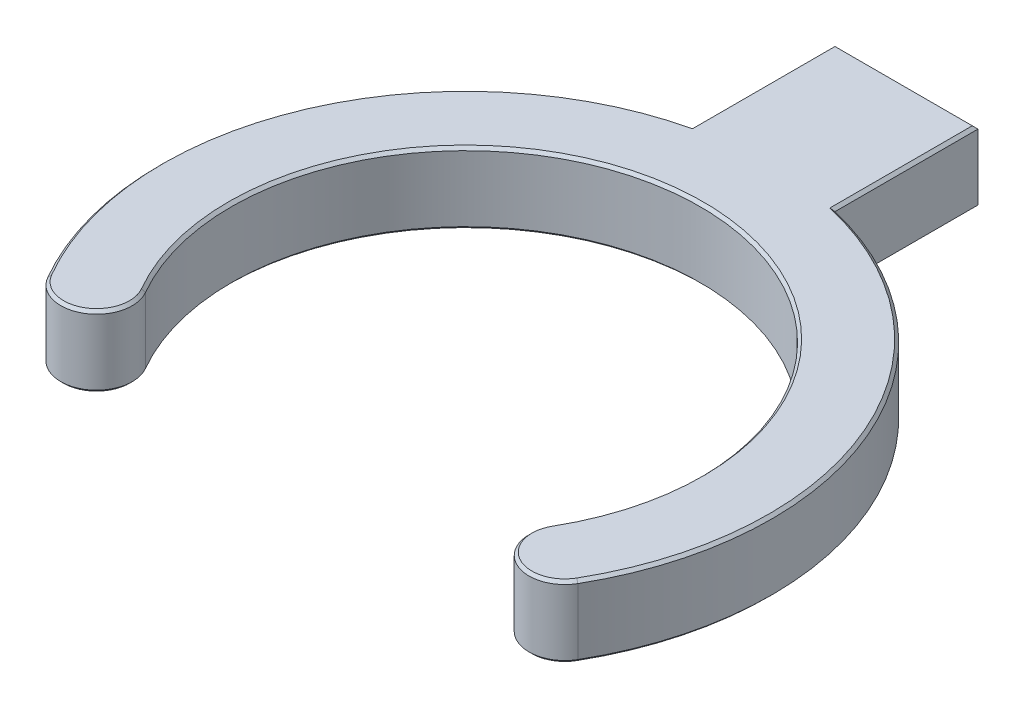
ISO-10303-21;
HEADER;
FILE_DESCRIPTION(('STEP AP214'),'2;1');
FILE_NAME('part.step','',(''),(''),'','','');
FILE_SCHEMA(('AUTOMOTIVE_DESIGN { 1 0 10303 214 1 1 1 1 }'));
ENDSEC;
DATA;
#1=APPLICATION_CONTEXT('core data for automotive mechanical design processes');
#2=APPLICATION_PROTOCOL_DEFINITION('international standard','automotive_design',2000,#1);
#3=PRODUCT_CONTEXT('',#1,'mechanical');
#4=PRODUCT('Part','Part','',(#3));
#5=PRODUCT_RELATED_PRODUCT_CATEGORY('part','',(#4));
#6=PRODUCT_DEFINITION_FORMATION('','',#4);
#7=PRODUCT_DEFINITION_CONTEXT('part definition',#1,'design');
#8=PRODUCT_DEFINITION('design','',#6,#7);
#9=PRODUCT_DEFINITION_SHAPE('','',#8);
#10=(LENGTH_UNIT() NAMED_UNIT(*) SI_UNIT(.MILLI.,.METRE.));
#11=(NAMED_UNIT(*) PLANE_ANGLE_UNIT() SI_UNIT($,.RADIAN.));
#12=(NAMED_UNIT(*) SI_UNIT($,.STERADIAN.) SOLID_ANGLE_UNIT());
#13=UNCERTAINTY_MEASURE_WITH_UNIT(LENGTH_MEASURE(1.E-05),#10,'distance_accuracy_value','');
#14=(GEOMETRIC_REPRESENTATION_CONTEXT(3) GLOBAL_UNCERTAINTY_ASSIGNED_CONTEXT((#13)) GLOBAL_UNIT_ASSIGNED_CONTEXT((#10,
#11,#12)) REPRESENTATION_CONTEXT('',''));
#15=CARTESIAN_POINT('',(0.,0.,0.));
#16=DIRECTION('',(0.,0.,1.));
#17=DIRECTION('',(1.,0.,0.));
#18=AXIS2_PLACEMENT_3D('',#15,#16,#17);
#19=CARTESIAN_POINT('',(0.,5.,0.));
#20=DIRECTION('',(0.,-1.,0.));
#21=DIRECTION('',(0.,0.,-1.));
#22=AXIS2_PLACEMENT_3D('',#19,#20,#21);
#23=CYLINDRICAL_SURFACE('',#22,21.4);
#24=DIRECTION('',(0.,-1.,0.));
#25=VECTOR('',#24,1.);
#26=CARTESIAN_POINT('',(-4.99999999999999,5.,-20.807690885824));
#27=LINE('',#26,#25);
#28=CARTESIAN_POINT('',(-4.99999999999999,4.79999999999999,-20.807690885824));
#29=VERTEX_POINT('',#28);
#30=CARTESIAN_POINT('',(-4.99999999999999,0.199999999999999,-20.807690885824));
#31=VERTEX_POINT('',#30);
#32=EDGE_CURVE('E315',#29,#31,#27,.T.);
#33=ORIENTED_EDGE('',*,*,#32,.T.);
#34=CARTESIAN_POINT('',(0.,0.199999999999999,0.));
#35=DIRECTION('',(0.,1.,0.));
#36=DIRECTION('',(0.,0.,1.));
#37=AXIS2_PLACEMENT_3D('',#34,#35,#36);
#38=CIRCLE('',#37,21.4);
#39=CARTESIAN_POINT('',(-18.532943640987,0.199999999999999,10.7));
#40=VERTEX_POINT('',#39);
#41=EDGE_CURVE('E239',#31,#40,#38,.T.);
#42=ORIENTED_EDGE('',*,*,#41,.T.);
#43=DIRECTION('',(0.,-1.,0.));
#44=VECTOR('',#43,1.);
#45=CARTESIAN_POINT('',(-18.532943640987,5.,10.7));
#46=LINE('',#45,#44);
#47=CARTESIAN_POINT('',(-18.532943640987,4.79999999999999,10.7));
#48=VERTEX_POINT('',#47);
#49=EDGE_CURVE('E178',#48,#40,#46,.T.);
#50=ORIENTED_EDGE('',*,*,#49,.F.);
#51=CARTESIAN_POINT('',(0.,4.79999999999999,0.));
#52=DIRECTION('',(0.,1.,0.));
#53=DIRECTION('',(0.,0.,1.));
#54=AXIS2_PLACEMENT_3D('',#51,#52,#53);
#55=CIRCLE('',#54,21.4);
#56=EDGE_CURVE('E237',#48,#29,#55,.F.);
#57=ORIENTED_EDGE('',*,*,#56,.T.);
#58=EDGE_LOOP('',(#33,#42,#50,#57));
#59=FACE_BOUND('',#58,.T.);
#60=ADVANCED_FACE('F41',(#59),#23,.T.);
#61=CARTESIAN_POINT('',(-16.3678801315259,5.,9.44999999999997));
#62=DIRECTION('',(0.,-1.,0.));
#63=DIRECTION('',(0.,0.,-1.));
#64=AXIS2_PLACEMENT_3D('',#61,#62,#63);
#65=CYLINDRICAL_SURFACE('',#64,2.5);
#66=ORIENTED_EDGE('',*,*,#49,.T.);
#67=CARTESIAN_POINT('',(-16.3678801315259,0.199999999999999,9.44999999999997));
#68=DIRECTION('',(0.,1.,0.));
#69=DIRECTION('',(0.,0.,1.));
#70=AXIS2_PLACEMENT_3D('',#67,#68,#69);
#71=CIRCLE('',#70,2.5);
#72=CARTESIAN_POINT('',(-14.2028166220648,0.199999999999999,8.19999999999996));
#73=VERTEX_POINT('',#72);
#74=EDGE_CURVE('E177',#40,#73,#71,.T.);
#75=ORIENTED_EDGE('',*,*,#74,.T.);
#76=DIRECTION('',(0.,-1.,0.));
#77=VECTOR('',#76,1.);
#78=CARTESIAN_POINT('',(-14.2028166220648,5.,8.19999999999996));
#79=LINE('',#78,#77);
#80=CARTESIAN_POINT('',(-14.2028166220648,4.79999999999999,8.19999999999996));
#81=VERTEX_POINT('',#80);
#82=EDGE_CURVE('E159',#81,#73,#79,.T.);
#83=ORIENTED_EDGE('',*,*,#82,.F.);
#84=CARTESIAN_POINT('',(-16.3678801315259,4.79999999999999,9.44999999999997));
#85=DIRECTION('',(0.,1.,0.));
#86=DIRECTION('',(0.,0.,1.));
#87=AXIS2_PLACEMENT_3D('',#84,#85,#86);
#88=CIRCLE('',#87,2.5);
#89=EDGE_CURVE('E174',#81,#48,#88,.F.);
#90=ORIENTED_EDGE('',*,*,#89,.T.);
#91=EDGE_LOOP('',(#66,#75,#83,#90));
#92=FACE_BOUND('',#91,.T.);
#93=ADVANCED_FACE('F172',(#92),#65,.T.);
#94=CARTESIAN_POINT('',(0.,5.,0.));
#95=DIRECTION('',(0.,-1.,0.));
#96=DIRECTION('',(0.,0.,-1.));
#97=AXIS2_PLACEMENT_3D('',#94,#95,#96);
#98=CYLINDRICAL_SURFACE('',#97,16.4);
#99=ORIENTED_EDGE('',*,*,#82,.T.);
#100=CARTESIAN_POINT('',(0.,0.199999999999999,0.));
#101=DIRECTION('',(0.,1.,0.));
#102=DIRECTION('',(0.,0.,1.));
#103=AXIS2_PLACEMENT_3D('',#100,#101,#102);
#104=CIRCLE('',#103,16.4);
#105=CARTESIAN_POINT('',(14.2028166220648,0.199999999999999,8.19999999999996));
#106=VERTEX_POINT('',#105);
#107=EDGE_CURVE('E166',#73,#106,#104,.F.);
#108=ORIENTED_EDGE('',*,*,#107,.T.);
#109=DIRECTION('',(0.,-1.,0.));
#110=VECTOR('',#109,1.);
#111=CARTESIAN_POINT('',(14.2028166220648,5.,8.19999999999996));
#112=LINE('',#111,#110);
#113=CARTESIAN_POINT('',(14.2028166220648,4.79999999999999,8.19999999999996));
#114=VERTEX_POINT('',#113);
#115=EDGE_CURVE('E161',#114,#106,#112,.T.);
#116=ORIENTED_EDGE('',*,*,#115,.F.);
#117=CARTESIAN_POINT('',(0.,4.79999999999999,0.));
#118=DIRECTION('',(0.,1.,0.));
#119=DIRECTION('',(0.,0.,1.));
#120=AXIS2_PLACEMENT_3D('',#117,#118,#119);
#121=CIRCLE('',#120,16.4);
#122=EDGE_CURVE('E156',#114,#81,#121,.T.);
#123=ORIENTED_EDGE('',*,*,#122,.T.);
#124=EDGE_LOOP('',(#99,#108,#116,#123));
#125=FACE_BOUND('',#124,.T.);
#126=ADVANCED_FACE('F158',(#125),#98,.F.);
#127=CARTESIAN_POINT('',(16.3678801315259,5.,9.44999999999995));
#128=DIRECTION('',(0.,-1.,0.));
#129=DIRECTION('',(0.,0.,-1.));
#130=AXIS2_PLACEMENT_3D('',#127,#128,#129);
#131=CYLINDRICAL_SURFACE('',#130,2.5);
#132=ORIENTED_EDGE('',*,*,#115,.T.);
#133=CARTESIAN_POINT('',(16.3678801315259,0.199999999999999,9.44999999999995));
#134=DIRECTION('',(0.,1.,0.));
#135=DIRECTION('',(0.,0.,1.));
#136=AXIS2_PLACEMENT_3D('',#133,#134,#135);
#137=CIRCLE('',#136,2.5);
#138=CARTESIAN_POINT('',(18.532943640987,0.199999999999999,10.7));
#139=VERTEX_POINT('',#138);
#140=EDGE_CURVE('E218',#106,#139,#137,.T.);
#141=ORIENTED_EDGE('',*,*,#140,.T.);
#142=DIRECTION('',(0.,-1.,0.));
#143=VECTOR('',#142,1.);
#144=CARTESIAN_POINT('',(18.532943640987,5.,10.7));
#145=LINE('',#144,#143);
#146=CARTESIAN_POINT('',(18.532943640987,4.79999999999999,10.7));
#147=VERTEX_POINT('',#146);
#148=EDGE_CURVE('E382',#147,#139,#145,.T.);
#149=ORIENTED_EDGE('',*,*,#148,.F.);
#150=CARTESIAN_POINT('',(16.3678801315259,4.79999999999999,9.44999999999995));
#151=DIRECTION('',(0.,1.,0.));
#152=DIRECTION('',(0.,0.,1.));
#153=AXIS2_PLACEMENT_3D('',#150,#151,#152);
#154=CIRCLE('',#153,2.5);
#155=EDGE_CURVE('E216',#147,#114,#154,.F.);
#156=ORIENTED_EDGE('',*,*,#155,.T.);
#157=EDGE_LOOP('',(#132,#141,#149,#156));
#158=FACE_BOUND('',#157,.T.);
#159=ADVANCED_FACE('F379',(#158),#131,.T.);
#160=CARTESIAN_POINT('',(0.,5.,0.));
#161=DIRECTION('',(0.,-1.,0.));
#162=DIRECTION('',(0.,0.,-1.));
#163=AXIS2_PLACEMENT_3D('',#160,#161,#162);
#164=CYLINDRICAL_SURFACE('',#163,21.4);
#165=ORIENTED_EDGE('',*,*,#148,.T.);
#166=CARTESIAN_POINT('',(0.,0.199999999999999,0.));
#167=DIRECTION('',(0.,1.,0.));
#168=DIRECTION('',(0.,0.,1.));
#169=AXIS2_PLACEMENT_3D('',#166,#167,#168);
#170=CIRCLE('',#169,21.4);
#171=CARTESIAN_POINT('',(4.99999999999995,0.199999999999999,-20.8076908858239));
#172=VERTEX_POINT('',#171);
#173=EDGE_CURVE('E222',#139,#172,#170,.T.);
#174=ORIENTED_EDGE('',*,*,#173,.T.);
#175=DIRECTION('',(0.,-1.,0.));
#176=VECTOR('',#175,1.);
#177=CARTESIAN_POINT('',(4.99999999999995,5.,-20.8076908858239));
#178=LINE('',#177,#176);
#179=CARTESIAN_POINT('',(4.99999999999995,4.79999999999999,-20.8076908858239));
#180=VERTEX_POINT('',#179);
#181=EDGE_CURVE('E385',#180,#172,#178,.T.);
#182=ORIENTED_EDGE('',*,*,#181,.F.);
#183=CARTESIAN_POINT('',(0.,4.79999999999999,0.));
#184=DIRECTION('',(0.,1.,0.));
#185=DIRECTION('',(0.,0.,1.));
#186=AXIS2_PLACEMENT_3D('',#183,#184,#185);
#187=CIRCLE('',#186,21.4);
#188=EDGE_CURVE('E220',#180,#147,#187,.F.);
#189=ORIENTED_EDGE('',*,*,#188,.T.);
#190=EDGE_LOOP('',(#165,#174,#182,#189));
#191=FACE_BOUND('',#190,.T.);
#192=ADVANCED_FACE('F434',(#191),#164,.T.);
#193=CARTESIAN_POINT('',(5.00000000000001,5.,-30.8076908858239));
#194=DIRECTION('',(-1.,0.,0.));
#195=DIRECTION('',(0.,0.,1.));
#196=AXIS2_PLACEMENT_3D('',#193,#194,#195);
#197=PLANE('',#196);
#198=ORIENTED_EDGE('',*,*,#181,.T.);
#199=DIRECTION('',(0.,0.,-1.));
#200=VECTOR('',#199,1.);
#201=CARTESIAN_POINT('',(5.00000000000001,0.199999999999999,-30.8076908858239));
#202=LINE('',#201,#200);
#203=CARTESIAN_POINT('',(5.00000000000001,0.199999999999999,-30.8076908858239));
#204=VERTEX_POINT('',#203);
#205=EDGE_CURVE('E226',#172,#204,#202,.T.);
#206=ORIENTED_EDGE('',*,*,#205,.T.);
#207=DIRECTION('',(0.,-1.,0.));
#208=VECTOR('',#207,1.);
#209=CARTESIAN_POINT('',(5.00000000000001,5.,-30.8076908858239));
#210=LINE('',#209,#208);
#211=CARTESIAN_POINT('',(5.00000000000001,4.79999999999999,-30.8076908858239));
#212=VERTEX_POINT('',#211);
#213=EDGE_CURVE('E389',#212,#204,#210,.T.);
#214=ORIENTED_EDGE('',*,*,#213,.F.);
#215=DIRECTION('',(0.,0.,1.));
#216=VECTOR('',#215,1.);
#217=CARTESIAN_POINT('',(4.99999999999996,4.79999999999999,-20.8076908858239));
#218=LINE('',#217,#216);
#219=EDGE_CURVE('E224',#212,#180,#218,.T.);
#220=ORIENTED_EDGE('',*,*,#219,.T.);
#221=EDGE_LOOP('',(#198,#206,#214,#220));
#222=FACE_BOUND('',#221,.T.);
#223=ADVANCED_FACE('F436',(#222),#197,.F.);
#224=CARTESIAN_POINT('',(-4.99999999999999,5.,-30.807690885824));
#225=DIRECTION('',(0.,0.,1.));
#226=DIRECTION('',(1.,0.,0.));
#227=AXIS2_PLACEMENT_3D('',#224,#225,#226);
#228=PLANE('',#227);
#229=ORIENTED_EDGE('',*,*,#213,.T.);
#230=DIRECTION('',(-1.,0.,0.));
#231=VECTOR('',#230,1.);
#232=CARTESIAN_POINT('',(-4.99999999999999,0.199999999999999,-30.807690885824));
#233=LINE('',#232,#231);
#234=CARTESIAN_POINT('',(-4.99999999999999,0.199999999999999,-30.807690885824));
#235=VERTEX_POINT('',#234);
#236=EDGE_CURVE('E230',#204,#235,#233,.T.);
#237=ORIENTED_EDGE('',*,*,#236,.T.);
#238=DIRECTION('',(0.,-1.,0.));
#239=VECTOR('',#238,1.);
#240=CARTESIAN_POINT('',(-4.99999999999999,5.,-30.807690885824));
#241=LINE('',#240,#239);
#242=CARTESIAN_POINT('',(-4.99999999999999,4.79999999999999,-30.807690885824));
#243=VERTEX_POINT('',#242);
#244=EDGE_CURVE('E394',#243,#235,#241,.T.);
#245=ORIENTED_EDGE('',*,*,#244,.F.);
#246=DIRECTION('',(1.,0.,0.));
#247=VECTOR('',#246,1.);
#248=CARTESIAN_POINT('',(5.00000000000001,4.79999999999999,-30.8076908858239));
#249=LINE('',#248,#247);
#250=EDGE_CURVE('E228',#243,#212,#249,.T.);
#251=ORIENTED_EDGE('',*,*,#250,.T.);
#252=EDGE_LOOP('',(#229,#237,#245,#251));
#253=FACE_BOUND('',#252,.T.);
#254=ADVANCED_FACE('F454',(#253),#228,.F.);
#255=CARTESIAN_POINT('',(-4.99999999999999,5.,-30.807690885824));
#256=DIRECTION('',(1.,0.,0.));
#257=DIRECTION('',(0.,0.,-1.));
#258=AXIS2_PLACEMENT_3D('',#255,#256,#257);
#259=PLANE('',#258);
#260=ORIENTED_EDGE('',*,*,#244,.T.);
#261=DIRECTION('',(0.,0.,1.));
#262=VECTOR('',#261,1.);
#263=CARTESIAN_POINT('',(-4.99999999999999,0.199999999999999,-30.807690885824));
#264=LINE('',#263,#262);
#265=EDGE_CURVE('E235',#235,#31,#264,.T.);
#266=ORIENTED_EDGE('',*,*,#265,.T.);
#267=ORIENTED_EDGE('',*,*,#32,.F.);
#268=DIRECTION('',(0.,0.,-1.));
#269=VECTOR('',#268,1.);
#270=CARTESIAN_POINT('',(-4.99999999999999,4.79999999999999,-30.807690885824));
#271=LINE('',#270,#269);
#272=EDGE_CURVE('E232',#29,#243,#271,.T.);
#273=ORIENTED_EDGE('',*,*,#272,.T.);
#274=EDGE_LOOP('',(#260,#266,#267,#273));
#275=FACE_BOUND('',#274,.T.);
#276=ADVANCED_FACE('F447',(#275),#259,.F.);
#277=CARTESIAN_POINT('',(0.,5.,0.));
#278=DIRECTION('',(0.,1.,0.));
#279=DIRECTION('',(0.,0.,1.));
#280=AXIS2_PLACEMENT_3D('',#277,#278,#279);
#281=PLANE('',#280);
#282=DIRECTION('',(-1.,0.,0.));
#283=VECTOR('',#282,1.);
#284=CARTESIAN_POINT('',(-4.99999999999999,5.,-30.6076908858239));
#285=LINE('',#284,#283);
#286=CARTESIAN_POINT('',(4.79999999999999,5.,-30.6076908858239));
#287=VERTEX_POINT('',#286);
#288=CARTESIAN_POINT('',(-4.79999999999997,5.,-30.6076908858239));
#289=VERTEX_POINT('',#288);
#290=EDGE_CURVE('E51',#287,#289,#285,.T.);
#291=ORIENTED_EDGE('',*,*,#290,.T.);
#292=DIRECTION('',(0.,0.,1.));
#293=VECTOR('',#292,1.);
#294=CARTESIAN_POINT('',(-4.79999999999997,5.,-20.807690885824));
#295=LINE('',#294,#293);
#296=CARTESIAN_POINT('',(-4.79999999999997,5.,-20.6494551986245));
#297=VERTEX_POINT('',#296);
#298=EDGE_CURVE('E11',#289,#297,#295,.T.);
#299=ORIENTED_EDGE('',*,*,#298,.T.);
#300=CARTESIAN_POINT('',(0.,5.,0.));
#301=DIRECTION('',(0.,1.,0.));
#302=DIRECTION('',(0.,0.,1.));
#303=AXIS2_PLACEMENT_3D('',#300,#301,#302);
#304=CIRCLE('',#303,21.2);
#305=CARTESIAN_POINT('',(-18.3597385602301,5.,10.5999999999999));
#306=VERTEX_POINT('',#305);
#307=EDGE_CURVE('E241',#297,#306,#304,.T.);
#308=ORIENTED_EDGE('',*,*,#307,.T.);
#309=CARTESIAN_POINT('',(-16.3678801315259,5.,9.44999999999997));
#310=DIRECTION('',(0.,1.,0.));
#311=DIRECTION('',(0.,0.,1.));
#312=AXIS2_PLACEMENT_3D('',#309,#310,#311);
#313=CIRCLE('',#312,2.29999999999998);
#314=CARTESIAN_POINT('',(-14.3760217028217,5.,8.29999999999997));
#315=VERTEX_POINT('',#314);
#316=EDGE_CURVE('E243',#306,#315,#313,.T.);
#317=ORIENTED_EDGE('',*,*,#316,.T.);
#318=CARTESIAN_POINT('',(0.,5.,0.));
#319=DIRECTION('',(0.,1.,0.));
#320=DIRECTION('',(0.,0.,1.));
#321=AXIS2_PLACEMENT_3D('',#318,#319,#320);
#322=CIRCLE('',#321,16.6);
#323=CARTESIAN_POINT('',(14.3760217028217,5.,8.29999999999997));
#324=VERTEX_POINT('',#323);
#325=EDGE_CURVE('E184',#315,#324,#322,.F.);
#326=ORIENTED_EDGE('',*,*,#325,.T.);
#327=CARTESIAN_POINT('',(16.3678801315259,5.,9.44999999999995));
#328=DIRECTION('',(0.,1.,0.));
#329=DIRECTION('',(0.,0.,1.));
#330=AXIS2_PLACEMENT_3D('',#327,#328,#329);
#331=CIRCLE('',#330,2.29999999999998);
#332=CARTESIAN_POINT('',(18.3597385602301,5.,10.5999999999999));
#333=VERTEX_POINT('',#332);
#334=EDGE_CURVE('E246',#324,#333,#331,.T.);
#335=ORIENTED_EDGE('',*,*,#334,.T.);
#336=CARTESIAN_POINT('',(0.,5.,0.));
#337=DIRECTION('',(0.,1.,0.));
#338=DIRECTION('',(0.,0.,1.));
#339=AXIS2_PLACEMENT_3D('',#336,#337,#338);
#340=CIRCLE('',#339,21.2);
#341=CARTESIAN_POINT('',(4.79999999999994,5.,-20.6494551986245));
#342=VERTEX_POINT('',#341);
#343=EDGE_CURVE('E248',#333,#342,#340,.T.);
#344=ORIENTED_EDGE('',*,*,#343,.T.);
#345=DIRECTION('',(0.,0.,-1.));
#346=VECTOR('',#345,1.);
#347=CARTESIAN_POINT('',(4.79999999999999,5.,-30.8076908858239));
#348=LINE('',#347,#346);
#349=EDGE_CURVE('E62',#342,#287,#348,.T.);
#350=ORIENTED_EDGE('',*,*,#349,.T.);
#351=EDGE_LOOP('',(#291,#299,#308,#317,#326,#335,#344,#350));
#352=FACE_BOUND('',#351,.T.);
#353=ADVANCED_FACE('F445',(#352),#281,.T.);
#354=CARTESIAN_POINT('',(0.,0.,0.));
#355=DIRECTION('',(0.,1.,0.));
#356=DIRECTION('',(0.,0.,1.));
#357=AXIS2_PLACEMENT_3D('',#354,#355,#356);
#358=PLANE('',#357);
#359=CARTESIAN_POINT('',(0.,0.,0.));
#360=DIRECTION('',(0.,1.,0.));
#361=DIRECTION('',(0.,0.,1.));
#362=AXIS2_PLACEMENT_3D('',#359,#360,#361);
#363=CIRCLE('',#362,16.6);
#364=CARTESIAN_POINT('',(14.3760217028217,0.,8.29999999999996));
#365=VERTEX_POINT('',#364);
#366=CARTESIAN_POINT('',(-14.3760217028217,0.,8.29999999999996));
#367=VERTEX_POINT('',#366);
#368=EDGE_CURVE('E211',#365,#367,#363,.T.);
#369=ORIENTED_EDGE('',*,*,#368,.T.);
#370=CARTESIAN_POINT('',(-16.3678801315259,0.,9.44999999999997));
#371=DIRECTION('',(0.,1.,0.));
#372=DIRECTION('',(0.,0.,1.));
#373=AXIS2_PLACEMENT_3D('',#370,#371,#372);
#374=CIRCLE('',#373,2.3);
#375=CARTESIAN_POINT('',(-18.3597385602301,0.,10.6));
#376=VERTEX_POINT('',#375);
#377=EDGE_CURVE('E167',#367,#376,#374,.F.);
#378=ORIENTED_EDGE('',*,*,#377,.T.);
#379=CARTESIAN_POINT('',(0.,0.,0.));
#380=DIRECTION('',(0.,1.,0.));
#381=DIRECTION('',(0.,0.,1.));
#382=AXIS2_PLACEMENT_3D('',#379,#380,#381);
#383=CIRCLE('',#382,21.2);
#384=CARTESIAN_POINT('',(-4.79999999999999,0.,-20.6494551986245));
#385=VERTEX_POINT('',#384);
#386=EDGE_CURVE('E196',#376,#385,#383,.F.);
#387=ORIENTED_EDGE('',*,*,#386,.T.);
#388=DIRECTION('',(0.,0.,-1.));
#389=VECTOR('',#388,1.);
#390=CARTESIAN_POINT('',(-4.79999999999998,0.,0.));
#391=LINE('',#390,#389);
#392=CARTESIAN_POINT('',(-4.79999999999999,0.,-30.607690885824));
#393=VERTEX_POINT('',#392);
#394=EDGE_CURVE('E201',#385,#393,#391,.T.);
#395=ORIENTED_EDGE('',*,*,#394,.T.);
#396=DIRECTION('',(1.,0.,0.));
#397=VECTOR('',#396,1.);
#398=CARTESIAN_POINT('',(0.,0.,-30.6076908858239));
#399=LINE('',#398,#397);
#400=CARTESIAN_POINT('',(4.80000000000001,0.,-30.6076908858239));
#401=VERTEX_POINT('',#400);
#402=EDGE_CURVE('E203',#393,#401,#399,.T.);
#403=ORIENTED_EDGE('',*,*,#402,.T.);
#404=DIRECTION('',(0.,0.,1.));
#405=VECTOR('',#404,1.);
#406=CARTESIAN_POINT('',(4.79999999999985,0.,0.));
#407=LINE('',#406,#405);
#408=CARTESIAN_POINT('',(4.79999999999996,0.,-20.6494551986245));
#409=VERTEX_POINT('',#408);
#410=EDGE_CURVE('E205',#401,#409,#407,.T.);
#411=ORIENTED_EDGE('',*,*,#410,.T.);
#412=CARTESIAN_POINT('',(0.,0.,0.));
#413=DIRECTION('',(0.,1.,0.));
#414=DIRECTION('',(0.,0.,1.));
#415=AXIS2_PLACEMENT_3D('',#412,#413,#414);
#416=CIRCLE('',#415,21.2);
#417=CARTESIAN_POINT('',(18.3597385602301,0.,10.5999999999999));
#418=VERTEX_POINT('',#417);
#419=EDGE_CURVE('E207',#409,#418,#416,.F.);
#420=ORIENTED_EDGE('',*,*,#419,.T.);
#421=CARTESIAN_POINT('',(16.3678801315259,0.,9.44999999999995));
#422=DIRECTION('',(0.,1.,0.));
#423=DIRECTION('',(0.,0.,1.));
#424=AXIS2_PLACEMENT_3D('',#421,#422,#423);
#425=CIRCLE('',#424,2.3);
#426=EDGE_CURVE('E209',#418,#365,#425,.F.);
#427=ORIENTED_EDGE('',*,*,#426,.T.);
#428=EDGE_LOOP('',(#369,#378,#387,#395,#403,#411,#420,#427));
#429=FACE_BOUND('',#428,.T.);
#430=ADVANCED_FACE('F429',(#429),#358,.F.);
#431=CARTESIAN_POINT('',(5.00000000000001,0.199999999999999,-30.8076908858239));
#432=DIRECTION('',(-0.707106781186543,0.707106781186552,0.));
#433=DIRECTION('',(0.,0.,-1.));
#434=AXIS2_PLACEMENT_3D('',#431,#432,#433);
#435=PLANE('',#434);
#436=CARTESIAN_POINT('',(4.99999999999995,0.199999999999999,-20.8076908858239));
#437=CARTESIAN_POINT('',(4.96663633879341,0.166636338793456,-20.7813949366994));
#438=CARTESIAN_POINT('',(4.93328784157517,0.13328784157521,-20.7550606549116));
#439=CARTESIAN_POINT('',(4.86662117490831,0.0666211749083561,-20.7023154258456));
#440=CARTESIAN_POINT('',(4.83330300545989,0.0333030054599357,-20.6759044785669));
#441=CARTESIAN_POINT('',(4.79999999999996,0.,-20.6494551986245));
#442=B_SPLINE_CURVE_WITH_KNOTS('',3,(#436,#437,#438,#439,#440,#441),.UNSPECIFIED.,.F.,.F.,(4,2,
4),(0.,0.162048296431665,0.324096593869448),.UNSPECIFIED.);
#443=EDGE_CURVE('E304',#409,#172,#442,.F.);
#444=ORIENTED_EDGE('',*,*,#443,.F.);
#445=ORIENTED_EDGE('',*,*,#410,.F.);
#446=DIRECTION('',(-0.57735026918963,-0.577350269189619,0.577350269189628));
#447=VECTOR('',#446,1.);
#448=CARTESIAN_POINT('',(1.66666666666663,-3.13333333333331,-27.4743575524906));
#449=LINE('',#448,#447);
#450=EDGE_CURVE('E311',#204,#401,#449,.T.);
#451=ORIENTED_EDGE('',*,*,#450,.F.);
#452=ORIENTED_EDGE('',*,*,#205,.F.);
#453=EDGE_LOOP('',(#444,#445,#451,#452));
#454=FACE_BOUND('',#453,.T.);
#455=ADVANCED_FACE('F300',(#454),#435,.F.);
#456=CARTESIAN_POINT('',(-4.99999999999999,0.199999999999999,-30.807690885824));
#457=DIRECTION('',(0.,0.707106781186554,0.707106781186541));
#458=DIRECTION('',(-1.,0.,0.));
#459=AXIS2_PLACEMENT_3D('',#456,#457,#458);
#460=PLANE('',#459);
#461=ORIENTED_EDGE('',*,*,#450,.T.);
#462=ORIENTED_EDGE('',*,*,#402,.F.);
#463=DIRECTION('',(0.577350269189627,-0.57735026918962,0.577350269189631));
#464=VECTOR('',#463,1.);
#465=CARTESIAN_POINT('',(-4.99999999999999,0.199999999999999,-30.807690885824));
#466=LINE('',#465,#464);
#467=EDGE_CURVE('E312',#235,#393,#466,.T.);
#468=ORIENTED_EDGE('',*,*,#467,.F.);
#469=ORIENTED_EDGE('',*,*,#236,.F.);
#470=EDGE_LOOP('',(#461,#462,#468,#469));
#471=FACE_BOUND('',#470,.T.);
#472=ADVANCED_FACE('F298',(#471),#460,.F.);
#473=CARTESIAN_POINT('',(0.,0.199999999999999,0.));
#474=DIRECTION('',(0.,1.,0.));
#475=DIRECTION('',(0.,0.,1.));
#476=AXIS2_PLACEMENT_3D('',#473,#474,#475);
#477=CONICAL_SURFACE('',#476,21.4,0.785398163397466);
#478=ORIENTED_EDGE('',*,*,#443,.T.);
#479=ORIENTED_EDGE('',*,*,#173,.F.);
#480=DIRECTION('',(0.612372435695808,0.707106781186536,0.353553390593274));
#481=VECTOR('',#480,1.);
#482=CARTESIAN_POINT('',(18.3597385602301,0.,10.5999999999999));
#483=LINE('',#482,#481);
#484=EDGE_CURVE('E268',#418,#139,#483,.T.);
#485=ORIENTED_EDGE('',*,*,#484,.F.);
#486=ORIENTED_EDGE('',*,*,#419,.F.);
#487=EDGE_LOOP('',(#478,#479,#485,#486));
#488=FACE_BOUND('',#487,.T.);
#489=ADVANCED_FACE('F291',(#488),#477,.T.);
#490=CARTESIAN_POINT('',(-4.99999999999999,0.199999999999999,-30.807690885824));
#491=DIRECTION('',(0.707106781186543,0.707106781186552,0.));
#492=DIRECTION('',(0.,0.,1.));
#493=AXIS2_PLACEMENT_3D('',#490,#491,#492);
#494=PLANE('',#493);
#495=ORIENTED_EDGE('',*,*,#467,.T.);
#496=ORIENTED_EDGE('',*,*,#394,.F.);
#497=CARTESIAN_POINT('',(-4.99999999999999,0.199999999999999,-20.807690885824));
#498=CARTESIAN_POINT('',(-4.96663633879345,0.166636338793458,-20.7813949366994));
#499=CARTESIAN_POINT('',(-4.9332878415752,0.133287841575213,-20.7550606549116));
#500=CARTESIAN_POINT('',(-4.86662117490835,0.0666211749083589,-20.7023154258456));
#501=CARTESIAN_POINT('',(-4.83330300545992,0.0333030054599371,-20.6759044785669));
#502=CARTESIAN_POINT('',(-4.79999999999999,0.,-20.6494551986245));
#503=B_SPLINE_CURVE_WITH_KNOTS('',3,(#497,#498,#499,#500,#501,#502),.UNSPECIFIED.,.F.,.F.,(4,2,
4),(0.,0.162048296431672,0.324096593869462),.UNSPECIFIED.);
#504=EDGE_CURVE('E259',#31,#385,#503,.T.);
#505=ORIENTED_EDGE('',*,*,#504,.F.);
#506=ORIENTED_EDGE('',*,*,#265,.F.);
#507=EDGE_LOOP('',(#495,#496,#505,#506));
#508=FACE_BOUND('',#507,.T.);
#509=ADVANCED_FACE('F271',(#508),#494,.F.);
#510=CARTESIAN_POINT('',(16.3678801315259,0.199999999999999,9.44999999999995));
#511=DIRECTION('',(0.,1.,0.));
#512=DIRECTION('',(0.,0.,1.));
#513=AXIS2_PLACEMENT_3D('',#510,#511,#512);
#514=CONICAL_SURFACE('',#513,2.5,0.785398163397455);
#515=ORIENTED_EDGE('',*,*,#484,.T.);
#516=ORIENTED_EDGE('',*,*,#140,.F.);
#517=DIRECTION('',(-0.6123724356958,0.707106781186541,-0.353553390593277));
#518=VECTOR('',#517,1.);
#519=CARTESIAN_POINT('',(14.3760217028217,0.,8.29999999999996));
#520=LINE('',#519,#518);
#521=EDGE_CURVE('E256',#365,#106,#520,.T.);
#522=ORIENTED_EDGE('',*,*,#521,.F.);
#523=ORIENTED_EDGE('',*,*,#426,.F.);
#524=EDGE_LOOP('',(#515,#516,#522,#523));
#525=FACE_BOUND('',#524,.T.);
#526=ADVANCED_FACE('F283',(#525),#514,.T.);
#527=CARTESIAN_POINT('',(0.,0.199999999999999,0.));
#528=DIRECTION('',(0.,1.,0.));
#529=DIRECTION('',(0.,0.,1.));
#530=AXIS2_PLACEMENT_3D('',#527,#528,#529);
#531=CONICAL_SURFACE('',#530,21.4,0.785398163397457);
#532=ORIENTED_EDGE('',*,*,#504,.T.);
#533=ORIENTED_EDGE('',*,*,#386,.F.);
#534=DIRECTION('',(0.612372435695802,-0.707106781186542,-0.353553390593271));
#535=VECTOR('',#534,1.);
#536=CARTESIAN_POINT('',(-18.532943640987,0.199999999999999,10.7));
#537=LINE('',#536,#535);
#538=EDGE_CURVE('E254',#40,#376,#537,.T.);
#539=ORIENTED_EDGE('',*,*,#538,.F.);
#540=ORIENTED_EDGE('',*,*,#41,.F.);
#541=EDGE_LOOP('',(#532,#533,#539,#540));
#542=FACE_BOUND('',#541,.T.);
#543=ADVANCED_FACE('F275',(#542),#531,.T.);
#544=CARTESIAN_POINT('',(0.,0.199999999999999,0.));
#545=DIRECTION('',(0.,-1.,0.));
#546=DIRECTION('',(0.,0.,-1.));
#547=AXIS2_PLACEMENT_3D('',#544,#545,#546);
#548=CONICAL_SURFACE('',#547,16.4,0.785398163397457);
#549=ORIENTED_EDGE('',*,*,#521,.T.);
#550=ORIENTED_EDGE('',*,*,#107,.F.);
#551=DIRECTION('',(0.612372435695797,0.707106781186544,-0.353553390593278));
#552=VECTOR('',#551,1.);
#553=CARTESIAN_POINT('',(-14.3760217028217,0.,8.29999999999996));
#554=LINE('',#553,#552);
#555=EDGE_CURVE('E252',#367,#73,#554,.T.);
#556=ORIENTED_EDGE('',*,*,#555,.F.);
#557=ORIENTED_EDGE('',*,*,#368,.F.);
#558=EDGE_LOOP('',(#549,#550,#556,#557));
#559=FACE_BOUND('',#558,.T.);
#560=ADVANCED_FACE('F282',(#559),#548,.F.);
#561=CARTESIAN_POINT('',(-16.3678801315259,0.199999999999999,9.44999999999997));
#562=DIRECTION('',(0.,1.,0.));
#563=DIRECTION('',(0.,0.,1.));
#564=AXIS2_PLACEMENT_3D('',#561,#562,#563);
#565=CONICAL_SURFACE('',#564,2.5,0.785398163397456);
#566=ORIENTED_EDGE('',*,*,#538,.T.);
#567=ORIENTED_EDGE('',*,*,#377,.F.);
#568=ORIENTED_EDGE('',*,*,#555,.T.);
#569=ORIENTED_EDGE('',*,*,#74,.F.);
#570=EDGE_LOOP('',(#566,#567,#568,#569));
#571=FACE_BOUND('',#570,.T.);
#572=ADVANCED_FACE('F412',(#571),#565,.T.);
#573=CARTESIAN_POINT('',(16.3678801315259,5.,9.44999999999995));
#574=DIRECTION('',(0.,-1.,0.));
#575=DIRECTION('',(0.,0.,-1.));
#576=AXIS2_PLACEMENT_3D('',#573,#574,#575);
#577=CONICAL_SURFACE('',#576,2.29999999999998,0.785398163397465);
#578=DIRECTION('',(0.612372435695807,0.707106781186534,0.353553390593279));
#579=VECTOR('',#578,1.);
#580=CARTESIAN_POINT('',(14.2028166220648,4.79999999999999,8.19999999999996));
#581=LINE('',#580,#579);
#582=EDGE_CURVE('E366',#114,#324,#581,.T.);
#583=ORIENTED_EDGE('',*,*,#582,.F.);
#584=ORIENTED_EDGE('',*,*,#155,.F.);
#585=DIRECTION('',(0.612372435695804,-0.707106781186538,0.353553390593275));
#586=VECTOR('',#585,1.);
#587=CARTESIAN_POINT('',(18.3597385602301,5.,10.5999999999999));
#588=LINE('',#587,#586);
#589=EDGE_CURVE('E46',#333,#147,#588,.T.);
#590=ORIENTED_EDGE('',*,*,#589,.F.);
#591=ORIENTED_EDGE('',*,*,#334,.F.);
#592=EDGE_LOOP('',(#583,#584,#590,#591));
#593=FACE_BOUND('',#592,.T.);
#594=ADVANCED_FACE('F44',(#593),#577,.T.);
#595=CARTESIAN_POINT('',(0.,5.,0.));
#596=DIRECTION('',(0.,-1.,0.));
#597=DIRECTION('',(0.,0.,-1.));
#598=AXIS2_PLACEMENT_3D('',#595,#596,#597);
#599=CONICAL_SURFACE('',#598,21.2,0.785398163397466);
#600=ORIENTED_EDGE('',*,*,#589,.T.);
#601=ORIENTED_EDGE('',*,*,#188,.F.);
#602=CARTESIAN_POINT('',(4.99999999999995,4.79999999999999,-20.8076908858239));
#603=CARTESIAN_POINT('',(4.96663633879341,4.83336366120653,-20.7813949366994));
#604=CARTESIAN_POINT('',(4.93328784157516,4.86671215842478,-20.7550606549115));
#605=CARTESIAN_POINT('',(4.8666211749083,4.93337882509164,-20.7023154258455));
#606=CARTESIAN_POINT('',(4.83330300545988,4.96669699454006,-20.6759044785669));
#607=CARTESIAN_POINT('',(4.79999999999994,5.,-20.6494551986245));
#608=B_SPLINE_CURVE_WITH_KNOTS('',3,(#602,#603,#604,#605,#606,#607),.UNSPECIFIED.,.F.,.F.,(4,2,
4),(0.,0.16204829643168,0.324096593869474),.UNSPECIFIED.);
#609=EDGE_CURVE('E187',#342,#180,#608,.F.);
#610=ORIENTED_EDGE('',*,*,#609,.F.);
#611=ORIENTED_EDGE('',*,*,#343,.F.);
#612=EDGE_LOOP('',(#600,#601,#610,#611));
#613=FACE_BOUND('',#612,.T.);
#614=ADVANCED_FACE('F358',(#613),#599,.T.);
#615=CARTESIAN_POINT('',(0.,5.,0.));
#616=DIRECTION('',(0.,1.,0.));
#617=DIRECTION('',(0.,0.,1.));
#618=AXIS2_PLACEMENT_3D('',#615,#616,#617);
#619=CONICAL_SURFACE('',#618,16.6,0.785398163397466);
#620=ORIENTED_EDGE('',*,*,#582,.T.);
#621=ORIENTED_EDGE('',*,*,#325,.F.);
#622=DIRECTION('',(-0.612372435695804,0.707106781186538,0.353553390593275));
#623=VECTOR('',#622,1.);
#624=CARTESIAN_POINT('',(-14.2028166220648,4.79999999999999,8.19999999999996));
#625=LINE('',#624,#623);
#626=EDGE_CURVE('E182',#81,#315,#625,.T.);
#627=ORIENTED_EDGE('',*,*,#626,.F.);
#628=ORIENTED_EDGE('',*,*,#122,.F.);
#629=EDGE_LOOP('',(#620,#621,#627,#628));
#630=FACE_BOUND('',#629,.T.);
#631=ADVANCED_FACE('F183',(#630),#619,.F.);
#632=CARTESIAN_POINT('',(4.79999999999983,5.,0.));
#633=DIRECTION('',(0.707106781186533,0.707106781186562,0.));
#634=DIRECTION('',(0.,0.,1.));
#635=AXIS2_PLACEMENT_3D('',#632,#633,#634);
#636=PLANE('',#635);
#637=ORIENTED_EDGE('',*,*,#609,.T.);
#638=ORIENTED_EDGE('',*,*,#219,.F.);
#639=DIRECTION('',(-0.577350269189637,0.577350269189611,0.57735026918963));
#640=VECTOR('',#639,1.);
#641=CARTESIAN_POINT('',(-5.40256362860831,15.2025636286078,-20.4051272572157));
#642=LINE('',#641,#640);
#643=EDGE_CURVE('E188',#287,#212,#642,.F.);
#644=ORIENTED_EDGE('',*,*,#643,.F.);
#645=ORIENTED_EDGE('',*,*,#349,.F.);
#646=EDGE_LOOP('',(#637,#638,#644,#645));
#647=FACE_BOUND('',#646,.T.);
#648=ADVANCED_FACE('F350',(#647),#636,.T.);
#649=CARTESIAN_POINT('',(-16.3678801315259,5.,9.44999999999997));
#650=DIRECTION('',(0.,-1.,0.));
#651=DIRECTION('',(0.,0.,-1.));
#652=AXIS2_PLACEMENT_3D('',#649,#650,#651);
#653=CONICAL_SURFACE('',#652,2.29999999999998,0.785398163397468);
#654=ORIENTED_EDGE('',*,*,#626,.T.);
#655=ORIENTED_EDGE('',*,*,#316,.F.);
#656=DIRECTION('',(0.612372435695811,0.707106781186531,-0.353553390593278));
#657=VECTOR('',#656,1.);
#658=CARTESIAN_POINT('',(-18.532943640987,4.79999999999999,10.7));
#659=LINE('',#658,#657);
#660=EDGE_CURVE('E193',#48,#306,#659,.T.);
#661=ORIENTED_EDGE('',*,*,#660,.F.);
#662=ORIENTED_EDGE('',*,*,#89,.F.);
#663=EDGE_LOOP('',(#654,#655,#661,#662));
#664=FACE_BOUND('',#663,.T.);
#665=ADVANCED_FACE('F191',(#664),#653,.T.);
#666=CARTESIAN_POINT('',(0.,5.,-30.6076908858239));
#667=DIRECTION('',(0.,0.70710678118656,-0.707106781186535));
#668=DIRECTION('',(1.,0.,0.));
#669=AXIS2_PLACEMENT_3D('',#666,#667,#668);
#670=PLANE('',#669);
#671=ORIENTED_EDGE('',*,*,#643,.T.);
#672=ORIENTED_EDGE('',*,*,#250,.F.);
#673=DIRECTION('',(0.577350269189633,0.577350269189611,0.577350269189633));
#674=VECTOR('',#673,1.);
#675=CARTESIAN_POINT('',(-3.19999999999991,6.6,-29.0076908858239));
#676=LINE('',#675,#674);
#677=EDGE_CURVE('E324',#289,#243,#676,.F.);
#678=ORIENTED_EDGE('',*,*,#677,.F.);
#679=ORIENTED_EDGE('',*,*,#290,.F.);
#680=EDGE_LOOP('',(#671,#672,#678,#679));
#681=FACE_BOUND('',#680,.T.);
#682=ADVANCED_FACE('F337',(#681),#670,.T.);
#683=CARTESIAN_POINT('',(0.,5.,0.));
#684=DIRECTION('',(0.,-1.,0.));
#685=DIRECTION('',(0.,0.,-1.));
#686=AXIS2_PLACEMENT_3D('',#683,#684,#685);
#687=CONICAL_SURFACE('',#686,21.2,0.785398163397466);
#688=ORIENTED_EDGE('',*,*,#660,.T.);
#689=ORIENTED_EDGE('',*,*,#307,.F.);
#690=CARTESIAN_POINT('',(-4.79999999999997,5.,-20.6494551986245));
#691=CARTESIAN_POINT('',(-4.83330300545991,4.96669699454006,-20.6759044785669));
#692=CARTESIAN_POINT('',(-4.86662117490833,4.93337882509164,-20.7023154258456));
#693=CARTESIAN_POINT('',(-4.9332878415752,4.86671215842478,-20.7550606549116));
#694=CARTESIAN_POINT('',(-4.96663633879345,4.83336366120653,-20.7813949366994));
#695=CARTESIAN_POINT('',(-4.99999999999999,4.79999999999998,-20.8076908858239));
#696=B_SPLINE_CURVE_WITH_KNOTS('',3,(#690,#691,#692,#693,#694,#695),.UNSPECIFIED.,.F.,.F.,(4,2,
4),(0.,0.162048297437802,0.324096593869486),.UNSPECIFIED.);
#697=EDGE_CURVE('E316',#29,#297,#696,.F.);
#698=ORIENTED_EDGE('',*,*,#697,.F.);
#699=ORIENTED_EDGE('',*,*,#56,.F.);
#700=EDGE_LOOP('',(#688,#689,#698,#699));
#701=FACE_BOUND('',#700,.T.);
#702=ADVANCED_FACE('F330',(#701),#687,.T.);
#703=CARTESIAN_POINT('',(-4.79999999999996,5.,0.));
#704=DIRECTION('',(-0.707106781186534,0.707106781186561,0.));
#705=DIRECTION('',(0.,0.,-1.));
#706=AXIS2_PLACEMENT_3D('',#703,#704,#705);
#707=PLANE('',#706);
#708=ORIENTED_EDGE('',*,*,#677,.T.);
#709=ORIENTED_EDGE('',*,*,#272,.F.);
#710=ORIENTED_EDGE('',*,*,#697,.T.);
#711=ORIENTED_EDGE('',*,*,#298,.F.);
#712=EDGE_LOOP('',(#708,#709,#710,#711));
#713=FACE_BOUND('',#712,.T.);
#714=ADVANCED_FACE('F327',(#713),#707,.T.);
#715=CLOSED_SHELL('',(#60,#93,#126,#159,#192,#223,#254,#276,#353,#430,#455,#472,#489,#509,#526,
#543,#560,#572,#594,#614,#631,#648,#665,#682,#702,#714));
#716=MANIFOLD_SOLID_BREP('B2',#715);
#717=ADVANCED_BREP_SHAPE_REPRESENTATION('',(#18,#716),#14);
#718=SHAPE_DEFINITION_REPRESENTATION(#9,#717);
ENDSEC;
END-ISO-10303-21;
